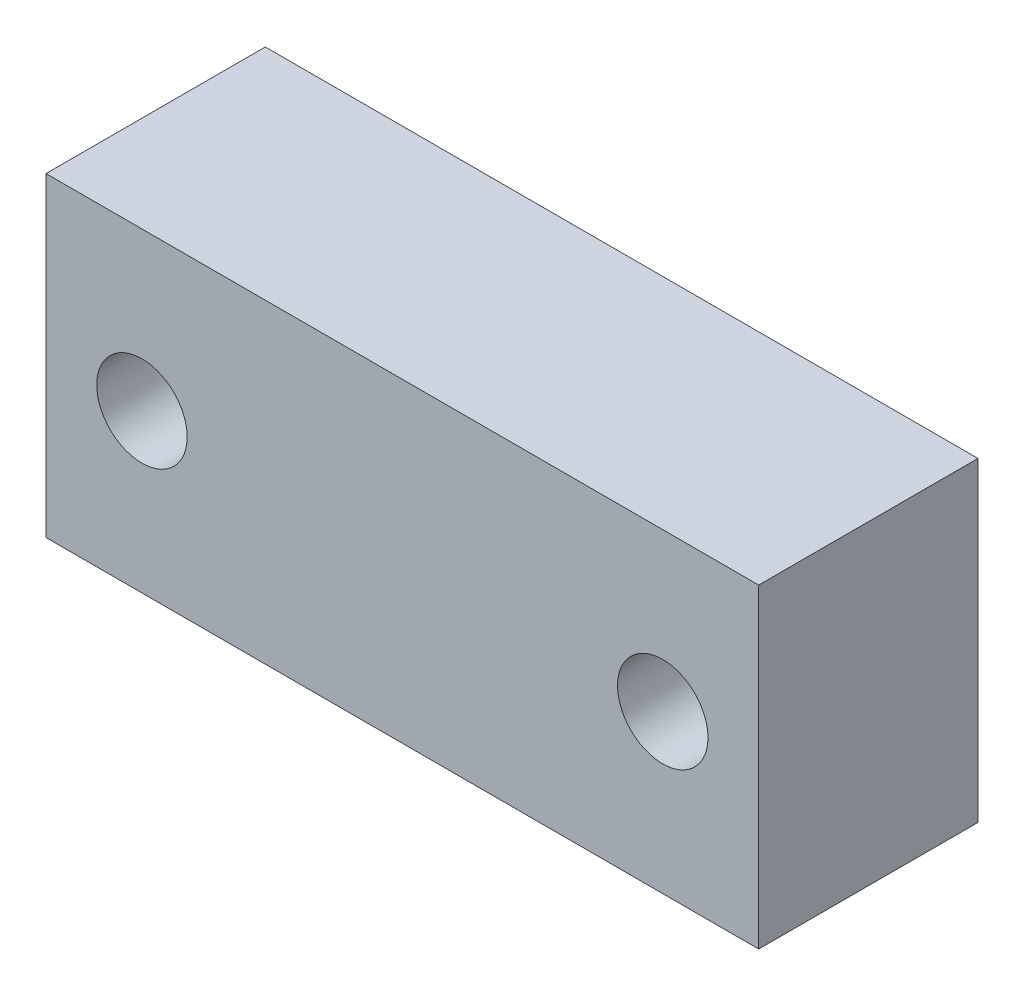
ISO-10303-21;
HEADER;
FILE_DESCRIPTION(('STEP AP214'),'2;1');
FILE_NAME('part.step','',(''),(''),'','','');
FILE_SCHEMA(('AUTOMOTIVE_DESIGN { 1 0 10303 214 1 1 1 1 }'));
ENDSEC;
DATA;
#1=APPLICATION_CONTEXT('core data for automotive mechanical design processes');
#2=APPLICATION_PROTOCOL_DEFINITION('international standard','automotive_design',2000,#1);
#3=PRODUCT_CONTEXT('',#1,'mechanical');
#4=PRODUCT('Part','Part','',(#3));
#5=PRODUCT_RELATED_PRODUCT_CATEGORY('part','',(#4));
#6=PRODUCT_DEFINITION_FORMATION('','',#4);
#7=PRODUCT_DEFINITION_CONTEXT('part definition',#1,'design');
#8=PRODUCT_DEFINITION('design','',#6,#7);
#9=PRODUCT_DEFINITION_SHAPE('','',#8);
#10=(LENGTH_UNIT() NAMED_UNIT(*) SI_UNIT(.MILLI.,.METRE.));
#11=(NAMED_UNIT(*) PLANE_ANGLE_UNIT() SI_UNIT($,.RADIAN.));
#12=(NAMED_UNIT(*) SI_UNIT($,.STERADIAN.) SOLID_ANGLE_UNIT());
#13=UNCERTAINTY_MEASURE_WITH_UNIT(LENGTH_MEASURE(1.E-05),#10,'distance_accuracy_value','');
#14=(GEOMETRIC_REPRESENTATION_CONTEXT(3) GLOBAL_UNCERTAINTY_ASSIGNED_CONTEXT((#13)) GLOBAL_UNIT_ASSIGNED_CONTEXT((#10,
#11,#12)) REPRESENTATION_CONTEXT('',''));
#15=CARTESIAN_POINT('',(0.,0.,0.));
#16=DIRECTION('',(0.,0.,1.));
#17=DIRECTION('',(1.,0.,0.));
#18=AXIS2_PLACEMENT_3D('',#15,#16,#17);
#19=CARTESIAN_POINT('',(26.,-11.5,16.));
#20=DIRECTION('',(-1.,0.,0.));
#21=DIRECTION('',(0.,0.,1.));
#22=AXIS2_PLACEMENT_3D('',#19,#20,#21);
#23=PLANE('',#22);
#24=DIRECTION('',(0.,1.,0.));
#25=VECTOR('',#24,1.);
#26=CARTESIAN_POINT('',(26.,-11.5,0.));
#27=LINE('',#26,#25);
#28=CARTESIAN_POINT('',(26.,-11.5,0.));
#29=VERTEX_POINT('',#28);
#30=CARTESIAN_POINT('',(26.,11.5,0.));
#31=VERTEX_POINT('',#30);
#32=EDGE_CURVE('E97',#29,#31,#27,.T.);
#33=ORIENTED_EDGE('',*,*,#32,.T.);
#34=DIRECTION('',(0.,0.,-1.));
#35=VECTOR('',#34,1.);
#36=CARTESIAN_POINT('',(26.,11.5,16.));
#37=LINE('',#36,#35);
#38=CARTESIAN_POINT('',(26.,11.5,16.));
#39=VERTEX_POINT('',#38);
#40=EDGE_CURVE('E11',#39,#31,#37,.T.);
#41=ORIENTED_EDGE('',*,*,#40,.F.);
#42=DIRECTION('',(0.,1.,0.));
#43=VECTOR('',#42,1.);
#44=CARTESIAN_POINT('',(26.,-11.5,16.));
#45=LINE('',#44,#43);
#46=CARTESIAN_POINT('',(26.,-11.5,16.));
#47=VERTEX_POINT('',#46);
#48=EDGE_CURVE('E85',#47,#39,#45,.T.);
#49=ORIENTED_EDGE('',*,*,#48,.F.);
#50=DIRECTION('',(0.,0.,-1.));
#51=VECTOR('',#50,1.);
#52=CARTESIAN_POINT('',(26.,-11.5,16.));
#53=LINE('',#52,#51);
#54=EDGE_CURVE('E93',#47,#29,#53,.T.);
#55=ORIENTED_EDGE('',*,*,#54,.T.);
#56=EDGE_LOOP('',(#33,#41,#49,#55));
#57=FACE_BOUND('',#56,.T.);
#58=ADVANCED_FACE('F34',(#57),#23,.F.);
#59=CARTESIAN_POINT('',(-26.,11.5,16.));
#60=DIRECTION('',(0.,-1.,0.));
#61=DIRECTION('',(0.,0.,-1.));
#62=AXIS2_PLACEMENT_3D('',#59,#60,#61);
#63=PLANE('',#62);
#64=DIRECTION('',(-1.,0.,0.));
#65=VECTOR('',#64,1.);
#66=CARTESIAN_POINT('',(-26.,11.5,0.));
#67=LINE('',#66,#65);
#68=CARTESIAN_POINT('',(-26.,11.5,0.));
#69=VERTEX_POINT('',#68);
#70=EDGE_CURVE('E89',#31,#69,#67,.T.);
#71=ORIENTED_EDGE('',*,*,#70,.T.);
#72=DIRECTION('',(0.,0.,-1.));
#73=VECTOR('',#72,1.);
#74=CARTESIAN_POINT('',(-26.,11.5,16.));
#75=LINE('',#74,#73);
#76=CARTESIAN_POINT('',(-26.,11.5,16.));
#77=VERTEX_POINT('',#76);
#78=EDGE_CURVE('E42',#77,#69,#75,.T.);
#79=ORIENTED_EDGE('',*,*,#78,.F.);
#80=DIRECTION('',(-1.,0.,0.));
#81=VECTOR('',#80,1.);
#82=CARTESIAN_POINT('',(-26.,11.5,16.));
#83=LINE('',#82,#81);
#84=EDGE_CURVE('E80',#39,#77,#83,.T.);
#85=ORIENTED_EDGE('',*,*,#84,.F.);
#86=ORIENTED_EDGE('',*,*,#40,.T.);
#87=EDGE_LOOP('',(#71,#79,#85,#86));
#88=FACE_BOUND('',#87,.T.);
#89=ADVANCED_FACE('F88',(#88),#63,.F.);
#90=CARTESIAN_POINT('',(-26.,-11.5,16.));
#91=DIRECTION('',(1.,0.,0.));
#92=DIRECTION('',(0.,0.,-1.));
#93=AXIS2_PLACEMENT_3D('',#90,#91,#92);
#94=PLANE('',#93);
#95=DIRECTION('',(0.,-1.,0.));
#96=VECTOR('',#95,1.);
#97=CARTESIAN_POINT('',(-26.,-11.5,0.));
#98=LINE('',#97,#96);
#99=CARTESIAN_POINT('',(-26.,-11.5,0.));
#100=VERTEX_POINT('',#99);
#101=EDGE_CURVE('E67',#69,#100,#98,.T.);
#102=ORIENTED_EDGE('',*,*,#101,.T.);
#103=DIRECTION('',(0.,0.,-1.));
#104=VECTOR('',#103,1.);
#105=CARTESIAN_POINT('',(-26.,-11.5,16.));
#106=LINE('',#105,#104);
#107=CARTESIAN_POINT('',(-26.,-11.5,16.));
#108=VERTEX_POINT('',#107);
#109=EDGE_CURVE('E90',#108,#100,#106,.T.);
#110=ORIENTED_EDGE('',*,*,#109,.F.);
#111=DIRECTION('',(0.,-1.,0.));
#112=VECTOR('',#111,1.);
#113=CARTESIAN_POINT('',(-26.,-11.5,16.));
#114=LINE('',#113,#112);
#115=EDGE_CURVE('E83',#77,#108,#114,.T.);
#116=ORIENTED_EDGE('',*,*,#115,.F.);
#117=ORIENTED_EDGE('',*,*,#78,.T.);
#118=EDGE_LOOP('',(#102,#110,#116,#117));
#119=FACE_BOUND('',#118,.T.);
#120=ADVANCED_FACE('F91',(#119),#94,.F.);
#121=CARTESIAN_POINT('',(-26.,-11.5,16.));
#122=DIRECTION('',(0.,1.,0.));
#123=DIRECTION('',(0.,0.,1.));
#124=AXIS2_PLACEMENT_3D('',#121,#122,#123);
#125=PLANE('',#124);
#126=DIRECTION('',(1.,0.,0.));
#127=VECTOR('',#126,1.);
#128=CARTESIAN_POINT('',(-26.,-11.5,0.));
#129=LINE('',#128,#127);
#130=EDGE_CURVE('E73',#100,#29,#129,.T.);
#131=ORIENTED_EDGE('',*,*,#130,.T.);
#132=ORIENTED_EDGE('',*,*,#54,.F.);
#133=DIRECTION('',(1.,0.,0.));
#134=VECTOR('',#133,1.);
#135=CARTESIAN_POINT('',(-26.,-11.5,16.));
#136=LINE('',#135,#134);
#137=EDGE_CURVE('E50',#108,#47,#136,.T.);
#138=ORIENTED_EDGE('',*,*,#137,.F.);
#139=ORIENTED_EDGE('',*,*,#109,.T.);
#140=EDGE_LOOP('',(#131,#132,#138,#139));
#141=FACE_BOUND('',#140,.T.);
#142=ADVANCED_FACE('F105',(#141),#125,.F.);
#143=CARTESIAN_POINT('',(0.,0.,16.));
#144=DIRECTION('',(0.,0.,-1.));
#145=DIRECTION('',(-1.,0.,0.));
#146=AXIS2_PLACEMENT_3D('',#143,#144,#145);
#147=PLANE('',#146);
#148=CARTESIAN_POINT('',(-19.,0.,16.));
#149=DIRECTION('',(0.,0.,1.));
#150=DIRECTION('',(1.,0.,0.));
#151=AXIS2_PLACEMENT_3D('',#148,#149,#150);
#152=CIRCLE('',#151,3.3);
#153=CARTESIAN_POINT('',(-15.7,0.,16.));
#154=VERTEX_POINT('',#153);
#155=EDGE_CURVE('E119',#154,#154,#152,.T.);
#156=ORIENTED_EDGE('',*,*,#155,.F.);
#157=EDGE_LOOP('',(#156));
#158=FACE_BOUND('',#157,.T.);
#159=CARTESIAN_POINT('',(19.,0.,16.));
#160=DIRECTION('',(0.,0.,1.));
#161=DIRECTION('',(1.,0.,0.));
#162=AXIS2_PLACEMENT_3D('',#159,#160,#161);
#163=CIRCLE('',#162,3.3);
#164=CARTESIAN_POINT('',(22.3,0.,16.));
#165=VERTEX_POINT('',#164);
#166=EDGE_CURVE('E113',#165,#165,#163,.T.);
#167=ORIENTED_EDGE('',*,*,#166,.F.);
#168=EDGE_LOOP('',(#167));
#169=FACE_BOUND('',#168,.T.);
#170=ORIENTED_EDGE('',*,*,#48,.T.);
#171=ORIENTED_EDGE('',*,*,#84,.T.);
#172=ORIENTED_EDGE('',*,*,#115,.T.);
#173=ORIENTED_EDGE('',*,*,#137,.T.);
#174=EDGE_LOOP('',(#170,#171,#172,#173));
#175=FACE_BOUND('',#174,.T.);
#176=ADVANCED_FACE('F81',(#158,#169,#175),#147,.F.);
#177=CARTESIAN_POINT('',(0.,0.,0.));
#178=DIRECTION('',(0.,0.,-1.));
#179=DIRECTION('',(-1.,0.,0.));
#180=AXIS2_PLACEMENT_3D('',#177,#178,#179);
#181=PLANE('',#180);
#182=CARTESIAN_POINT('',(-19.,0.,0.));
#183=DIRECTION('',(0.,0.,-1.));
#184=DIRECTION('',(-1.,0.,0.));
#185=AXIS2_PLACEMENT_3D('',#182,#183,#184);
#186=CIRCLE('',#185,3.3);
#187=CARTESIAN_POINT('',(-22.3,0.,0.));
#188=VERTEX_POINT('',#187);
#189=EDGE_CURVE('E116',#188,#188,#186,.T.);
#190=ORIENTED_EDGE('',*,*,#189,.F.);
#191=EDGE_LOOP('',(#190));
#192=FACE_BOUND('',#191,.T.);
#193=CARTESIAN_POINT('',(19.,0.,0.));
#194=DIRECTION('',(0.,0.,-1.));
#195=DIRECTION('',(-1.,0.,0.));
#196=AXIS2_PLACEMENT_3D('',#193,#194,#195);
#197=CIRCLE('',#196,3.3);
#198=CARTESIAN_POINT('',(15.7,0.,0.));
#199=VERTEX_POINT('',#198);
#200=EDGE_CURVE('E100',#199,#199,#197,.T.);
#201=ORIENTED_EDGE('',*,*,#200,.F.);
#202=EDGE_LOOP('',(#201));
#203=FACE_BOUND('',#202,.T.);
#204=ORIENTED_EDGE('',*,*,#32,.F.);
#205=ORIENTED_EDGE('',*,*,#130,.F.);
#206=ORIENTED_EDGE('',*,*,#101,.F.);
#207=ORIENTED_EDGE('',*,*,#70,.F.);
#208=EDGE_LOOP('',(#204,#205,#206,#207));
#209=FACE_BOUND('',#208,.T.);
#210=ADVANCED_FACE('F108',(#192,#203,#209),#181,.T.);
#211=CARTESIAN_POINT('',(19.,0.,16.));
#212=DIRECTION('',(0.,0.,1.));
#213=DIRECTION('',(1.,0.,0.));
#214=AXIS2_PLACEMENT_3D('',#211,#212,#213);
#215=CYLINDRICAL_SURFACE('',#214,3.3);
#216=ORIENTED_EDGE('',*,*,#166,.T.);
#217=EDGE_LOOP('',(#216));
#218=FACE_BOUND('',#217,.T.);
#219=ORIENTED_EDGE('',*,*,#200,.T.);
#220=EDGE_LOOP('',(#219));
#221=FACE_BOUND('',#220,.T.);
#222=ADVANCED_FACE('F131',(#218,#221),#215,.F.);
#223=CARTESIAN_POINT('',(-19.,0.,16.));
#224=DIRECTION('',(0.,0.,1.));
#225=DIRECTION('',(1.,0.,0.));
#226=AXIS2_PLACEMENT_3D('',#223,#224,#225);
#227=CYLINDRICAL_SURFACE('',#226,3.3);
#228=ORIENTED_EDGE('',*,*,#155,.T.);
#229=EDGE_LOOP('',(#228));
#230=FACE_BOUND('',#229,.T.);
#231=ORIENTED_EDGE('',*,*,#189,.T.);
#232=EDGE_LOOP('',(#231));
#233=FACE_BOUND('',#232,.T.);
#234=ADVANCED_FACE('F123',(#230,#233),#227,.F.);
#235=CLOSED_SHELL('',(#58,#89,#120,#142,#176,#210,#222,#234));
#236=MANIFOLD_SOLID_BREP('B2',#235);
#237=ADVANCED_BREP_SHAPE_REPRESENTATION('',(#18,#236),#14);
#238=SHAPE_DEFINITION_REPRESENTATION(#9,#237);
ENDSEC;
END-ISO-10303-21;
